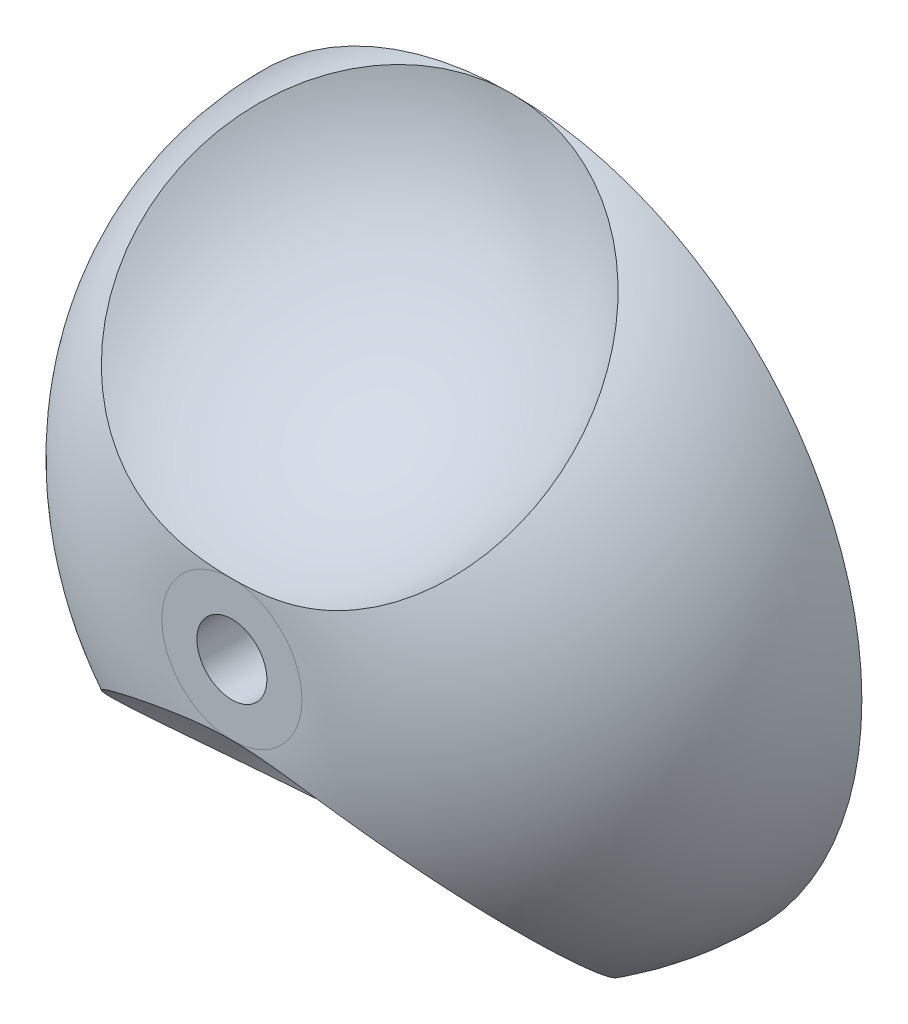
ISO-10303-21;
HEADER;
FILE_DESCRIPTION(('STEP AP214'),'2;1');
FILE_NAME('part.step','',(''),(''),'','','');
FILE_SCHEMA(('AUTOMOTIVE_DESIGN { 1 0 10303 214 1 1 1 1 }'));
ENDSEC;
DATA;
#1=APPLICATION_CONTEXT('core data for automotive mechanical design processes');
#2=APPLICATION_PROTOCOL_DEFINITION('international standard','automotive_design',2000,#1);
#3=PRODUCT_CONTEXT('',#1,'mechanical');
#4=PRODUCT('Part','Part','',(#3));
#5=PRODUCT_RELATED_PRODUCT_CATEGORY('part','',(#4));
#6=PRODUCT_DEFINITION_FORMATION('','',#4);
#7=PRODUCT_DEFINITION_CONTEXT('part definition',#1,'design');
#8=PRODUCT_DEFINITION('design','',#6,#7);
#9=PRODUCT_DEFINITION_SHAPE('','',#8);
#10=(LENGTH_UNIT() NAMED_UNIT(*) SI_UNIT(.MILLI.,.METRE.));
#11=(NAMED_UNIT(*) PLANE_ANGLE_UNIT() SI_UNIT($,.RADIAN.));
#12=(NAMED_UNIT(*) SI_UNIT($,.STERADIAN.) SOLID_ANGLE_UNIT());
#13=UNCERTAINTY_MEASURE_WITH_UNIT(LENGTH_MEASURE(1.E-05),#10,'distance_accuracy_value','');
#14=(GEOMETRIC_REPRESENTATION_CONTEXT(3) GLOBAL_UNCERTAINTY_ASSIGNED_CONTEXT((#13)) GLOBAL_UNIT_ASSIGNED_CONTEXT((#10,
#11,#12)) REPRESENTATION_CONTEXT('',''));
#15=CARTESIAN_POINT('',(0.,0.,0.));
#16=DIRECTION('',(0.,0.,1.));
#17=DIRECTION('',(1.,0.,0.));
#18=AXIS2_PLACEMENT_3D('',#15,#16,#17);
#19=CARTESIAN_POINT('',(0.,0.,0.));
#20=DIRECTION('',(0.,0.,1.));
#21=DIRECTION('',(1.,0.,0.));
#22=AXIS2_PLACEMENT_3D('',#19,#20,#21);
#23=DEGENERATE_TOROIDAL_SURFACE('',#22,1.,4.,.T.);
#24=CARTESIAN_POINT('',(0.,0.,4.));
#25=DIRECTION('',(0.,0.,1.));
#26=DIRECTION('',(1.,0.,0.));
#27=AXIS2_PLACEMENT_3D('',#24,#25,#26);
#28=CIRCLE('',#27,1.);
#29=CARTESIAN_POINT('',(0.,-1.,4.));
#30=VERTEX_POINT('',#29);
#31=CARTESIAN_POINT('',(0.,1.,4.));
#32=VERTEX_POINT('',#31);
#33=EDGE_CURVE('E70',#30,#32,#28,.T.);
#34=ORIENTED_EDGE('',*,*,#33,.F.);
#35=CARTESIAN_POINT('',(-2.68785256871974,-3.99009537818454,1.215122763269));
#36=CARTESIAN_POINT('',(-2.76276451588691,-3.89916073588399,1.32039915206711));
#37=CARTESIAN_POINT('',(-2.82630403159081,-3.80367601552847,1.42982797246107));
#38=CARTESIAN_POINT('',(-2.92858222586906,-3.60573129160405,1.65386104492423));
#39=CARTESIAN_POINT('',(-2.96732419486037,-3.50327221546794,1.76846460818907));
#40=CARTESIAN_POINT('',(-3.01858699121286,-3.29371307193877,1.99956610308444));
#41=CARTESIAN_POINT('',(-3.03107652508974,-3.18660762093246,2.1160661289085));
#42=CARTESIAN_POINT('',(-3.02900941210653,-2.97061806774979,2.34720600118296));
#43=CARTESIAN_POINT('',(-3.01445174538993,-2.86173389865755,2.46184577732537));
#44=CARTESIAN_POINT('',(-2.95877246549111,-2.64668994445519,2.68397464934982));
#45=CARTESIAN_POINT('',(-2.91802711668018,-2.54051337783973,2.79154160646406));
#46=CARTESIAN_POINT('',(-2.81126639125041,-2.33231218322158,2.99773946556896));
#47=CARTESIAN_POINT('',(-2.74525971880925,-2.23028613847391,3.09637343109876));
#48=CARTESIAN_POINT('',(-2.59180618334586,-2.03591698510883,3.27902886428214));
#49=CARTESIAN_POINT('',(-2.50496838457332,-1.94338986695267,3.36336623906516));
#50=CARTESIAN_POINT('',(-2.31140923011984,-1.7676590947729,3.51788377704945));
#51=CARTESIAN_POINT('',(-2.20467744590479,-1.6844603675447,3.58805647467932));
#52=CARTESIAN_POINT('',(-1.9762899617377,-1.53112161073129,3.71109361056722));
#53=CARTESIAN_POINT('',(-1.8549039792481,-1.46079189911861,3.76421997688716));
#54=CARTESIAN_POINT('',(-1.66364449706594,-1.36553169229796,3.83114812034313));
#55=CARTESIAN_POINT('',(-1.59840349655805,-1.33549909942534,3.85132224541395));
#56=CARTESIAN_POINT('',(-1.46524998739118,-1.27898830267704,3.88746711400418));
#57=CARTESIAN_POINT('',(-1.39733737406747,-1.25251023823539,3.90343769265401));
#58=CARTESIAN_POINT('',(-1.25859130124168,-1.20303689388791,3.93141224843576));
#59=CARTESIAN_POINT('',(-1.18773387116892,-1.18008329605418,3.94337048251933));
#60=CARTESIAN_POINT('',(-1.04431853900747,-1.13816949489072,3.96334576712812));
#61=CARTESIAN_POINT('',(-0.971760824638734,-1.1192088530054,3.97136325060426));
#62=CARTESIAN_POINT('',(-0.825178250663127,-1.08534275535579,3.98397808290889));
#63=CARTESIAN_POINT('',(-0.751149450289338,-1.07045042412369,3.98856444362583));
#64=CARTESIAN_POINT('',(-0.602241158925003,-1.04487669177826,3.99508410367305));
#65=CARTESIAN_POINT('',(-0.527361444378159,-1.03419642488505,3.99701668874472));
#66=CARTESIAN_POINT('',(-0.397254300439622,-1.01939052035284,3.99901712726014));
#67=CARTESIAN_POINT('',(-0.342140969834603,-1.01427523035279,3.99944603400479));
#68=CARTESIAN_POINT('',(-0.231748265652536,-1.00633564833123,3.99992232572262));
#69=CARTESIAN_POINT('',(-0.176468894796942,-1.00351131896357,3.99996971691519));
#70=CARTESIAN_POINT('',(-0.0658129419274977,-1.0001583032092,4.00000943350571));
#71=CARTESIAN_POINT('',(-0.0104363260277121,-0.999630717350689,4.00000173250988));
#72=CARTESIAN_POINT('',(0.100283866720961,-1.00087383395343,3.99999787024052));
#73=CARTESIAN_POINT('',(0.155627444217608,-1.00264448976813,4.00000170873278));
#74=CARTESIAN_POINT('',(0.32133287073632,-1.01139625671704,3.99971437177758));
#75=CARTESIAN_POINT('',(0.431548254253826,-1.02181176947845,3.99912531940127));
#76=CARTESIAN_POINT('',(0.595795941727272,-1.04423709322932,3.99505135230761));
#77=CARTESIAN_POINT('',(0.650354104598244,-1.05284324701586,3.99316239486198));
#78=CARTESIAN_POINT('',(0.758994764936388,-1.07229945427399,3.98790901926961));
#79=CARTESIAN_POINT('',(0.813077326242182,-1.08314920164958,3.98454480232408));
#80=CARTESIAN_POINT('',(0.943113359680714,-1.11206838256645,3.9742384522311));
#81=CARTESIAN_POINT('',(1.0187523203948,-1.13125937563373,3.96638832946859));
#82=CARTESIAN_POINT('',(1.16823871031159,-1.1739712115442,3.94646856099277));
#83=CARTESIAN_POINT('',(1.24208606815496,-1.19749222653225,3.9343987475038));
#84=CARTESIAN_POINT('',(1.38729878411459,-1.24864909302946,3.90574390730558));
#85=CARTESIAN_POINT('',(1.45866846098975,-1.27627729000052,3.88916723336584));
#86=CARTESIAN_POINT('',(1.59847571070001,-1.33545115528689,3.85138536991425));
#87=CARTESIAN_POINT('',(1.66691332450524,-1.36699676883955,3.83018024510167));
#88=CARTESIAN_POINT('',(1.86746327945552,-1.46739727249268,3.75944783044363));
#89=CARTESIAN_POINT('',(1.99443496878165,-1.54188257655096,3.7028764165854));
#90=CARTESIAN_POINT('',(2.23032507529285,-1.70340813694752,3.57234420571799));
#91=CARTESIAN_POINT('',(2.33922067412379,-1.79046400652526,3.49836171026531));
#92=CARTESIAN_POINT('',(2.53058082008716,-1.96978695112975,3.33947389812048));
#93=CARTESIAN_POINT('',(2.61408537328086,-2.0615840950855,3.25528877853483));
#94=CARTESIAN_POINT('',(2.7593155605056,-2.25140722446396,3.07603070137653));
#95=CARTESIAN_POINT('',(2.82105373088989,-2.34942958594993,2.98096405295794));
#96=CARTESIAN_POINT('',(2.92158817278353,-2.54971186412174,2.7822286818873));
#97=CARTESIAN_POINT('',(2.96025141393027,-2.65199278384891,2.67851393485025));
#98=CARTESIAN_POINT('',(3.0132853027199,-2.8576435631143,2.4660538088163));
#99=CARTESIAN_POINT('',(3.02765010903163,-2.96101367848657,2.35730722662203));
#100=CARTESIAN_POINT('',(3.03202364680104,-3.16849019829019,2.13561079647896));
#101=CARTESIAN_POINT('',(3.02150266010644,-3.27256473581878,2.02262083554639));
#102=CARTESIAN_POINT('',(2.97562097486999,-3.47664502536426,1.79804058640769));
#103=CARTESIAN_POINT('',(2.94025831952917,-3.57665045619767,1.68645040916855));
#104=CARTESIAN_POINT('',(2.8446473055138,-3.77300949849115,1.46477835522955));
#105=CARTESIAN_POINT('',(2.78373379261222,-3.86918403526235,1.35482487329234));
#106=CARTESIAN_POINT('',(2.63900822949701,-4.05266352809207,1.14288910818514));
#107=CARTESIAN_POINT('',(2.55519276290728,-4.13996715817422,1.04090801721001));
#108=CARTESIAN_POINT('',(2.36422895341981,-4.30646397461738,0.844704215798498));
#109=CARTESIAN_POINT('',(2.25643190812502,-4.38531740077047,0.750824640926884));
#110=CARTESIAN_POINT('',(2.02236953392529,-4.5300779999149,0.577182321163478));
#111=CARTESIAN_POINT('',(1.89610138615585,-4.59598319328044,0.497421735075975));
#112=CARTESIAN_POINT('',(1.62434267517022,-4.71553386562883,0.351879590309183));
#113=CARTESIAN_POINT('',(1.47836602369268,-4.76871914802692,0.286627497229731));
#114=CARTESIAN_POINT('',(1.17463772507538,-4.85909704586991,0.175265954459468));
#115=CARTESIAN_POINT('',(1.01688429569387,-4.89628723491182,0.129159409121787));
#116=CARTESIAN_POINT('',(0.689420671712319,-4.95488174866756,0.0563416503327031));
#117=CARTESIAN_POINT('',(0.519500826144521,-4.97582306916326,0.0301996210045938));
#118=CARTESIAN_POINT('',(0.176457662415036,-4.99987185014877,0.0001673227965405));
#119=CARTESIAN_POINT('',(0.00333400500981355,-5.00297741108944,-0.00372057596753313));
#120=CARTESIAN_POINT('',(-0.344054515644482,-4.99121343631994,0.0109811938658755));
#121=CARTESIAN_POINT('',(-0.518295293107231,-4.9760637655734,0.0299211678650338));
#122=CARTESIAN_POINT('',(-0.860226602893486,-4.92755177349686,0.0903334414249287));
#123=CARTESIAN_POINT('',(-1.02791693256499,-4.89418888917987,0.131806437501668));
#124=CARTESIAN_POINT('',(-1.35144814085421,-4.80991042690516,0.235955043142145));
#125=CARTESIAN_POINT('',(-1.50731722268928,-4.75903834034667,0.298578110541568));
#126=CARTESIAN_POINT('',(-1.80292771789151,-4.64065334687158,0.443191501398668));
#127=CARTESIAN_POINT('',(-1.94267143579426,-4.57314282215112,0.525179052290718));
#128=CARTESIAN_POINT('',(-2.19590549954469,-4.42616173707251,0.702018950156101));
#129=CARTESIAN_POINT('',(-2.31027595412719,-4.34734237743963,0.796152957544263));
#130=CARTESIAN_POINT('',(-2.51662011799843,-4.17740887309898,0.997018909711905));
#131=CARTESIAN_POINT('',(-2.60860051913612,-4.08629841458925,1.10374707620546));
#132=CARTESIAN_POINT('',(-2.68785256871974,-3.99009537818454,1.215122763269));
#133=B_SPLINE_CURVE_WITH_KNOTS('',3,(#35,#36,#37,#38,#39,#40,#41,#42,#43,#44,#45,#46,#47,#48,
#49,#50,#51,#52,#53,#54,#55,#56,#57,#58,#59,#60,#61,#62,#63,#64,#65,#66,#67,#68,#69,#70,#71,#72,
#73,#74,#75,#76,#77,#78,#79,#80,#81,#82,#83,#84,#85,#86,#87,#88,#89,#90,#91,#92,#93,#94,#95,#96,
#97,#98,#99,#100,#101,#102,#103,#104,#105,#106,#107,#108,#109,#110,#111,#112,#113,#114,#115,
#116,#117,#118,#119,#120,#121,#122,#123,#124,#125,#126,#127,#128,#129,#130,#131,#132),
.UNSPECIFIED.,.T.,.F.,(4,2,2,2,2,2,2,2,2,2,2,2,2,2,2,2,2,2,2,2,2,2,2,2,2,2,2,2,2,2,2,2,2,2,2,2,
2,2,2,2,2,2,2,2,2,2,2,2,4),(0.,0.473444832509781,0.946826830012268,1.42077279008101,
1.89473662137761,2.3620383227892,2.82917915296798,3.28404297268014,3.73914590848304,
4.18687767862586,4.41047315235764,4.63407739454182,4.8601504992398,5.086198760841,
5.31296787514922,5.53979801197289,5.70580722719746,5.87181373616378,6.03789978154669,
6.20398245599567,6.53561253680027,6.70135497090616,6.8670748074869,7.10211541620659,
7.33716537124676,7.57178263262213,7.80639661458653,8.27682956323703,8.74785191975102,
9.19560407158833,9.64309791755833,10.0931473167763,10.5433048922687,11.0031304443295,
11.4629922212948,11.9356514256741,12.4083811770484,12.8959203498568,13.3835340035127,
13.8867630945978,14.3900684969768,14.9072364697676,15.4244595211073,15.9497217088748,
16.4750001338934,16.9989831164194,17.5228911216052,18.0239154067187,18.5247897633475),.UNSPECIFIED.);
#134=CARTESIAN_POINT('',(5.5711312047268E-12,-5.,0.));
#135=VERTEX_POINT('',#134);
#136=EDGE_CURVE('E50',#30,#135,#133,.T.);
#137=ORIENTED_EDGE('',*,*,#136,.T.);
#138=CARTESIAN_POINT('',(0.,0.,0.));
#139=DIRECTION('',(0.,0.,1.));
#140=DIRECTION('',(1.,0.,0.));
#141=AXIS2_PLACEMENT_3D('',#138,#139,#140);
#142=CIRCLE('',#141,5.);
#143=CARTESIAN_POINT('',(0.,5.,0.));
#144=VERTEX_POINT('',#143);
#145=EDGE_CURVE('E56',#135,#144,#142,.T.);
#146=ORIENTED_EDGE('',*,*,#145,.T.);
#147=CARTESIAN_POINT('',(-3.02244932109296,3.23137483234667,2.06692857923755));
#148=CARTESIAN_POINT('',(-3.01056098892929,3.33988518672583,1.94907254593831));
#149=CARTESIAN_POINT('',(-2.98484428465853,3.44687850433875,1.83105575795997));
#150=CARTESIAN_POINT('',(-2.90683920685162,3.6549903905875,1.59850642179033));
#151=CARTESIAN_POINT('',(-2.85451526985404,3.75610089410521,1.48397875490774));
#152=CARTESIAN_POINT('',(-2.72527633785325,3.9497459846112,1.26218577079237));
#153=CARTESIAN_POINT('',(-2.64840460180711,4.04229529116258,1.15490807736332));
#154=CARTESIAN_POINT('',(-2.47254247637445,4.21693080825522,0.950551461583477));
#155=CARTESIAN_POINT('',(-2.37355699397919,4.29901933368428,0.853470283663602));
#156=CARTESIAN_POINT('',(-2.15386115705173,4.45287957498721,0.670053644218873));
#157=CARTESIAN_POINT('',(-2.03269810583792,4.52436614132601,0.584021481293347));
#158=CARTESIAN_POINT('',(-1.77380808990372,4.65330714882385,0.427825015307538));
#159=CARTESIAN_POINT('',(-1.6360779202604,4.71075886839375,0.35766379007977));
#160=CARTESIAN_POINT('',(-1.34332271522426,4.81219827085277,0.233177809780155));
#161=CARTESIAN_POINT('',(-1.18789018727079,4.85570608305732,0.179420035341073));
#162=CARTESIAN_POINT('',(-0.867804179468464,4.92600300157309,0.0922897427702927));
#163=CARTESIAN_POINT('',(-0.70314938717497,4.95278972164027,0.0589201342200959));
#164=CARTESIAN_POINT('',(-0.364959514986359,4.98968033544262,0.0129116845400861));
#165=CARTESIAN_POINT('',(-0.19130564261783,4.9993580833472,0.000802440099472478));
#166=CARTESIAN_POINT('',(0.15617308104373,5.00058020284781,-0.000725296216896354));
#167=CARTESIAN_POINT('',(0.329997945175897,4.99212308915794,0.0098580704831683));
#168=CARTESIAN_POINT('',(0.674736398991781,4.95702112346587,0.0536486448704324));
#169=CARTESIAN_POINT('',(0.845602104113577,4.93019134409352,0.0870858782367104));
#170=CARTESIAN_POINT('',(1.17762029779988,4.85858481262144,0.17586328780573));
#171=CARTESIAN_POINT('',(1.33877293154238,4.81380832884161,0.231203136543868));
#172=CARTESIAN_POINT('',(1.64521715889434,4.70755870441802,0.361589843400167));
#173=CARTESIAN_POINT('',(1.79063209545383,4.64623094320586,0.436464930186054));
#174=CARTESIAN_POINT('',(2.06264065266806,4.50790691401544,0.603879447351058));
#175=CARTESIAN_POINT('',(2.18923638542397,4.43091240663538,0.696416892796599));
#176=CARTESIAN_POINT('',(2.41664454448281,4.26497601159852,0.893811552267187));
#177=CARTESIAN_POINT('',(2.51800813624377,4.1763694181238,0.998315280455394));
#178=CARTESIAN_POINT('',(2.69543847513123,3.98787562289416,1.21808910860465));
#179=CARTESIAN_POINT('',(2.7715096198553,3.8879903862069,1.33335733247407));
#180=CARTESIAN_POINT('',(2.89358601608705,3.68281800858481,1.56705946879325));
#181=CARTESIAN_POINT('',(2.94047899781359,3.57780766067268,1.68527256950097));
#182=CARTESIAN_POINT('',(3.00615309103615,3.36226687498018,1.92446286128642));
#183=CARTESIAN_POINT('',(3.0249386088288,3.25173730523452,2.04543961609738));
#184=CARTESIAN_POINT('',(3.03327367368129,3.03187217686202,2.28215871434753));
#185=CARTESIAN_POINT('',(3.02376363690231,2.92261673198784,2.39794243169342));
#186=CARTESIAN_POINT('',(2.97746213244467,2.7047639398318,2.62456038087836));
#187=CARTESIAN_POINT('',(2.94067753602624,2.59616643374175,2.73539585187064));
#188=CARTESIAN_POINT('',(2.8421437050705,2.38590296393647,2.94525669502255));
#189=CARTESIAN_POINT('',(2.78116714821517,2.28412694800412,3.04453482527807));
#190=CARTESIAN_POINT('',(2.63586368965104,2.08696204077151,3.23176632419903));
#191=CARTESIAN_POINT('',(2.55153467884806,1.99157372734811,3.31971866891614));
#192=CARTESIAN_POINT('',(2.36415262420851,1.8121180565322,3.47953381027528));
#193=CARTESIAN_POINT('',(2.26157737308193,1.72784000308655,3.55172148608839));
#194=CARTESIAN_POINT('',(2.03939333247956,1.57052297471852,3.68035125445794));
#195=CARTESIAN_POINT('',(1.91979691024304,1.49747591905035,3.73680469185441));
#196=CARTESIAN_POINT('',(1.73104886416055,1.39828365746167,3.80844899736128));
#197=CARTESIAN_POINT('',(1.66686760807712,1.36706081424747,3.83009274432962));
#198=CARTESIAN_POINT('',(1.53566636109315,1.30809542632378,3.86917468271327));
#199=CARTESIAN_POINT('',(1.46864631556859,1.28035294862424,3.88661279316041));
#200=CARTESIAN_POINT('',(1.33225225943368,1.22855054227452,3.91732531253533));
#201=CARTESIAN_POINT('',(1.26287746469257,1.20449185531878,3.93059831910767));
#202=CARTESIAN_POINT('',(1.12229040262458,1.1602304177465,3.95317649932572));
#203=CARTESIAN_POINT('',(1.05107823835761,1.14002745139016,3.9624818950078));
#204=CARTESIAN_POINT('',(0.880861736614838,1.09691405854261,3.98026027046952));
#205=CARTESIAN_POINT('',(0.781254094044231,1.07573355094349,3.98717287723924));
#206=CARTESIAN_POINT('',(0.580467859699268,1.04102892841154,3.99610818781052));
#207=CARTESIAN_POINT('',(0.479288255759919,1.027509975992,3.9981275974695));
#208=CARTESIAN_POINT('',(0.326786465776123,1.0130419729057,3.99956042260437));
#209=CARTESIAN_POINT('',(0.275724743067765,1.00918580417016,3.99977076074694));
#210=CARTESIAN_POINT('',(0.173491342885155,1.00343634988161,3.99998785859562));
#211=CARTESIAN_POINT('',(0.122319674347119,1.00154291043053,3.99999463426426));
#212=CARTESIAN_POINT('',(0.0199450689673378,0.999722143165563,4.00000287301048));
#213=CARTESIAN_POINT('',(-0.0312578653584015,0.999794673831322,4.00000433647045));
#214=CARTESIAN_POINT('',(-0.133620629407986,1.00190456364321,3.99999117099967));
#215=CARTESIAN_POINT('',(-0.1847804584173,1.00394195474236,3.99997654180722));
#216=CARTESIAN_POINT('',(-0.341671651838796,1.01321128804819,3.99959915261673));
#217=CARTESIAN_POINT('',(-0.447234937641735,1.02366858907709,3.9988807181841));
#218=CARTESIAN_POINT('',(-0.657099953970818,1.05292403560304,3.99337257660942));
#219=CARTESIAN_POINT('',(-0.761401880264933,1.07172086925237,3.98858350968856));
#220=CARTESIAN_POINT('',(-0.967143798939297,1.11735043033608,3.97238928270985));
#221=CARTESIAN_POINT('',(-1.06859659719242,1.14413732363729,3.96102152002205));
#222=CARTESIAN_POINT('',(-1.26788539936245,1.20543371912765,3.93040287674273));
#223=CARTESIAN_POINT('',(-1.36572245240916,1.23994096038513,3.9111543027082));
#224=CARTESIAN_POINT('',(-1.59693800403264,1.332435964919,3.8542619169368));
#225=CARTESIAN_POINT('',(-1.72780825433698,1.39417722737836,3.81227943507801));
#226=CARTESIAN_POINT('',(-1.97580234439914,1.53077110583047,3.71136709227318));
#227=CARTESIAN_POINT('',(-2.09289581661267,1.60565181235893,3.65240074505985));
#228=CARTESIAN_POINT('',(-2.30955576645415,1.76622629612403,3.5190944231068));
#229=CARTESIAN_POINT('',(-2.4091278137374,1.85191662230831,3.4447593501301));
#230=CARTESIAN_POINT('',(-2.58789457759995,2.03161832090664,3.28298971663467));
#231=CARTESIAN_POINT('',(-2.66710102488499,2.12562486099829,3.19556274326163));
#232=CARTESIAN_POINT('',(-2.80273056153261,2.31885204872866,3.01080792699107));
#233=CARTESIAN_POINT('',(-2.85927515846758,2.41804157520319,2.9135364876052));
#234=CARTESIAN_POINT('',(-2.94881249932681,2.61944539194417,2.71168305973857));
#235=CARTESIAN_POINT('',(-2.98182265634724,2.72165738744894,2.60710653931345));
#236=CARTESIAN_POINT('',(-3.0167231413675,2.89222837908579,2.42946323776179));
#237=CARTESIAN_POINT('',(-3.02532621664847,2.96048733586619,2.35754344350487));
#238=CARTESIAN_POINT('',(-3.03186782100401,3.09648280815705,2.21274578733114));
#239=CARTESIAN_POINT('',(-3.02980683749023,3.16421934740342,2.13986796935365));
#240=CARTESIAN_POINT('',(-3.02244932109296,3.23137483234667,2.06692857923755));
#241=B_SPLINE_CURVE_WITH_KNOTS('',3,(#147,#148,#149,#150,#151,#152,#153,#154,#155,#156,#157,
#158,#159,#160,#161,#162,#163,#164,#165,#166,#167,#168,#169,#170,#171,#172,#173,#174,#175,#176,
#177,#178,#179,#180,#181,#182,#183,#184,#185,#186,#187,#188,#189,#190,#191,#192,#193,#194,#195,
#196,#197,#198,#199,#200,#201,#202,#203,#204,#205,#206,#207,#208,#209,#210,#211,#212,#213,#214,
#215,#216,#217,#218,#219,#220,#221,#222,#223,#224,#225,#226,#227,#228,#229,#230,#231,#232,#233,
#234,#235,#236,#237,#238,#239,#240),.UNSPECIFIED.,.T.,.F.,(4,2,2,2,2,2,2,2,2,2,2,2,2,2,2,2,2,2,
2,2,2,2,2,2,2,2,2,2,2,2,2,2,2,2,2,2,2,2,2,2,2,2,2,2,2,2,4),(0.,0.481551205876166,
0.963747755807076,1.44509920903269,1.92634395734244,2.4188086099422,2.91136868392038,
3.41940826591765,3.92752033297921,4.44811891682839,4.96876014049952,5.49472035271665,
6.02067270163328,6.54214774510195,7.0635642185613,7.57232661350152,8.08100050361268,
8.57332576943028,9.06557384726182,9.54164654106756,10.0175993389549,10.4794377169151,
10.9413178197619,11.3925230049839,11.8434020116103,12.0669406580827,12.2904836078441,
12.5141017420812,12.7377073605042,13.0434212258948,13.349340843391,13.5029334569393,
13.656514026344,13.810083540281,13.9636555516436,14.2815125027869,14.599319471254,
14.9153373309973,15.231262764632,15.6810677163002,16.1318462803294,16.5824812924174,
17.0328561516316,17.4807828183733,17.9283777199365,18.2264164008819,18.5244414597866),.UNSPECIFIED.);
#242=EDGE_CURVE('E11',#144,#32,#241,.T.);
#243=ORIENTED_EDGE('',*,*,#242,.T.);
#244=EDGE_LOOP('',(#34,#137,#146,#243));
#245=FACE_BOUND('',#244,.T.);
#246=ADVANCED_FACE('F33',(#245),#23,.T.);
#247=EDGE_CURVE('E75',#144,#135,#142,.T.);
#248=ORIENTED_EDGE('',*,*,#247,.T.);
#249=EDGE_CURVE('E62',#135,#30,#133,.T.);
#250=ORIENTED_EDGE('',*,*,#249,.T.);
#251=EDGE_CURVE('E80',#32,#30,#28,.T.);
#252=ORIENTED_EDGE('',*,*,#251,.F.);
#253=EDGE_CURVE('E37',#32,#144,#241,.T.);
#254=ORIENTED_EDGE('',*,*,#253,.T.);
#255=EDGE_LOOP('',(#248,#250,#252,#254));
#256=FACE_BOUND('',#255,.T.);
#257=ADVANCED_FACE('F78',(#256),#23,.T.);
#258=CARTESIAN_POINT('',(0.,0.,4.));
#259=DIRECTION('',(0.,0.,1.));
#260=DIRECTION('',(1.,0.,0.));
#261=AXIS2_PLACEMENT_3D('',#258,#259,#260);
#262=PLANE('',#261);
#263=CARTESIAN_POINT('',(0.,0.,4.));
#264=DIRECTION('',(0.,0.,1.));
#265=DIRECTION('',(1.,0.,0.));
#266=AXIS2_PLACEMENT_3D('',#263,#264,#265);
#267=CIRCLE('',#266,0.5);
#268=CARTESIAN_POINT('',(0.5,0.,4.));
#269=VERTEX_POINT('',#268);
#270=EDGE_CURVE('E68',#269,#269,#267,.T.);
#271=ORIENTED_EDGE('',*,*,#270,.F.);
#272=EDGE_LOOP('',(#271));
#273=FACE_BOUND('',#272,.T.);
#274=ORIENTED_EDGE('',*,*,#251,.T.);
#275=ORIENTED_EDGE('',*,*,#33,.T.);
#276=EDGE_LOOP('',(#274,#275));
#277=FACE_BOUND('',#276,.T.);
#278=ADVANCED_FACE('F86',(#273,#277),#262,.T.);
#279=CARTESIAN_POINT('',(0.,0.,0.));
#280=DIRECTION('',(0.,0.,1.));
#281=DIRECTION('',(1.,0.,0.));
#282=AXIS2_PLACEMENT_3D('',#279,#280,#281);
#283=PLANE('',#282);
#284=CARTESIAN_POINT('',(0.,0.,0.));
#285=DIRECTION('',(0.,0.,-1.));
#286=DIRECTION('',(-1.,0.,0.));
#287=AXIS2_PLACEMENT_3D('',#284,#285,#286);
#288=CIRCLE('',#287,0.5);
#289=CARTESIAN_POINT('',(-0.5,0.,0.));
#290=VERTEX_POINT('',#289);
#291=EDGE_CURVE('E111',#290,#290,#288,.T.);
#292=ORIENTED_EDGE('',*,*,#291,.F.);
#293=EDGE_LOOP('',(#292));
#294=FACE_BOUND('',#293,.T.);
#295=ORIENTED_EDGE('',*,*,#247,.F.);
#296=ORIENTED_EDGE('',*,*,#145,.F.);
#297=EDGE_LOOP('',(#295,#296));
#298=FACE_BOUND('',#297,.T.);
#299=ADVANCED_FACE('F74',(#294,#298),#283,.F.);
#300=CARTESIAN_POINT('',(0.,5.,4.));
#301=DIRECTION('',(0.,0.,-1.));
#302=DIRECTION('',(0.,-1.,0.));
#303=AXIS2_PLACEMENT_3D('',#300,#301,#302);
#304=SPHERICAL_SURFACE('',#303,4.);
#305=ORIENTED_EDGE('',*,*,#253,.F.);
#306=ORIENTED_EDGE('',*,*,#242,.F.);
#307=EDGE_LOOP('',(#305,#306));
#308=FACE_BOUND('',#307,.T.);
#309=ADVANCED_FACE('F88',(#308),#304,.F.);
#310=CARTESIAN_POINT('',(0.,-5.,4.));
#311=DIRECTION('',(0.,0.,-1.));
#312=DIRECTION('',(0.,1.,0.));
#313=AXIS2_PLACEMENT_3D('',#310,#311,#312);
#314=SPHERICAL_SURFACE('',#313,4.);
#315=ORIENTED_EDGE('',*,*,#249,.F.);
#316=ORIENTED_EDGE('',*,*,#136,.F.);
#317=EDGE_LOOP('',(#315,#316));
#318=FACE_BOUND('',#317,.T.);
#319=ADVANCED_FACE('F63',(#318),#314,.F.);
#320=CARTESIAN_POINT('',(0.,0.,4.2626836112861));
#321=DIRECTION('',(0.,0.,-1.));
#322=DIRECTION('',(-1.,0.,0.));
#323=AXIS2_PLACEMENT_3D('',#320,#321,#322);
#324=CYLINDRICAL_SURFACE('',#323,0.5);
#325=ORIENTED_EDGE('',*,*,#270,.T.);
#326=EDGE_LOOP('',(#325));
#327=FACE_BOUND('',#326,.T.);
#328=ORIENTED_EDGE('',*,*,#291,.T.);
#329=EDGE_LOOP('',(#328));
#330=FACE_BOUND('',#329,.T.);
#331=ADVANCED_FACE('F94',(#327,#330),#324,.F.);
#332=CLOSED_SHELL('',(#246,#257,#278,#299,#309,#319,#331));
#333=MANIFOLD_SOLID_BREP('B2',#332);
#334=ADVANCED_BREP_SHAPE_REPRESENTATION('',(#18,#333),#14);
#335=SHAPE_DEFINITION_REPRESENTATION(#9,#334);
ENDSEC;
END-ISO-10303-21;
